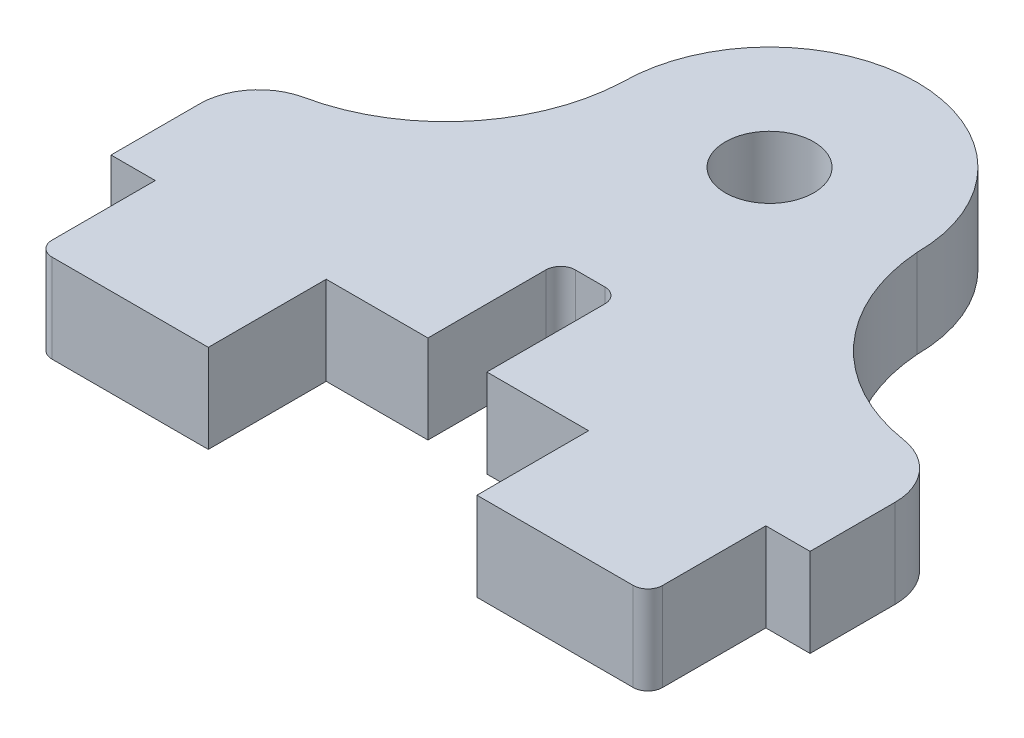
ISO-10303-21;
HEADER;
FILE_DESCRIPTION(('STEP AP214'),'2;1');
FILE_NAME('part.step','',(''),(''),'','','');
FILE_SCHEMA(('AUTOMOTIVE_DESIGN { 1 0 10303 214 1 1 1 1 }'));
ENDSEC;
DATA;
#1=APPLICATION_CONTEXT('core data for automotive mechanical design processes');
#2=APPLICATION_PROTOCOL_DEFINITION('international standard','automotive_design',2000,#1);
#3=PRODUCT_CONTEXT('',#1,'mechanical');
#4=PRODUCT('Part','Part','',(#3));
#5=PRODUCT_RELATED_PRODUCT_CATEGORY('part','',(#4));
#6=PRODUCT_DEFINITION_FORMATION('','',#4);
#7=PRODUCT_DEFINITION_CONTEXT('part definition',#1,'design');
#8=PRODUCT_DEFINITION('design','',#6,#7);
#9=PRODUCT_DEFINITION_SHAPE('','',#8);
#10=(LENGTH_UNIT() NAMED_UNIT(*) SI_UNIT(.MILLI.,.METRE.));
#11=(NAMED_UNIT(*) PLANE_ANGLE_UNIT() SI_UNIT($,.RADIAN.));
#12=(NAMED_UNIT(*) SI_UNIT($,.STERADIAN.) SOLID_ANGLE_UNIT());
#13=UNCERTAINTY_MEASURE_WITH_UNIT(LENGTH_MEASURE(1.E-05),#10,'distance_accuracy_value','');
#14=(GEOMETRIC_REPRESENTATION_CONTEXT(3) GLOBAL_UNCERTAINTY_ASSIGNED_CONTEXT((#13)) GLOBAL_UNIT_ASSIGNED_CONTEXT((#10,
#11,#12)) REPRESENTATION_CONTEXT('',''));
#15=CARTESIAN_POINT('',(0.,0.,0.));
#16=DIRECTION('',(0.,0.,1.));
#17=DIRECTION('',(1.,0.,0.));
#18=AXIS2_PLACEMENT_3D('',#15,#16,#17);
#19=CARTESIAN_POINT('',(11.2433699404445,3.,-0.455995380189233));
#20=DIRECTION('',(0.,-1.,0.));
#21=DIRECTION('',(0.,0.,-1.));
#22=AXIS2_PLACEMENT_3D('',#19,#20,#21);
#23=CYLINDRICAL_SURFACE('',#22,6.26);
#24=CARTESIAN_POINT('',(11.2433699404445,3.,-0.455995380189233));
#25=DIRECTION('',(0.,-1.,0.));
#26=DIRECTION('',(0.,0.,1.));
#27=AXIS2_PLACEMENT_3D('',#24,#25,#26);
#28=CIRCLE('',#27,6.26);
#29=CARTESIAN_POINT('',(10.2772699273665,3.,5.72900670265041));
#30=VERTEX_POINT('',#29);
#31=CARTESIAN_POINT('',(5.,3.,0.));
#32=VERTEX_POINT('',#31);
#33=EDGE_CURVE('E204',#30,#32,#28,.T.);
#34=ORIENTED_EDGE('',*,*,#33,.F.);
#35=DIRECTION('',(0.,-1.,0.));
#36=VECTOR('',#35,1.);
#37=CARTESIAN_POINT('',(10.2772699273665,3.,5.72900670265041));
#38=LINE('',#37,#36);
#39=CARTESIAN_POINT('',(10.2772699273665,0.,5.72900670265041));
#40=VERTEX_POINT('',#39);
#41=EDGE_CURVE('E259',#30,#40,#38,.T.);
#42=ORIENTED_EDGE('',*,*,#41,.T.);
#43=CARTESIAN_POINT('',(11.2433699404445,0.,-0.455995380189233));
#44=DIRECTION('',(0.,-1.,0.));
#45=DIRECTION('',(0.,0.,1.));
#46=AXIS2_PLACEMENT_3D('',#43,#44,#45);
#47=CIRCLE('',#46,6.26);
#48=CARTESIAN_POINT('',(5.,0.,0.));
#49=VERTEX_POINT('',#48);
#50=EDGE_CURVE('E232',#40,#49,#47,.T.);
#51=ORIENTED_EDGE('',*,*,#50,.T.);
#52=DIRECTION('',(0.,-1.,0.));
#53=VECTOR('',#52,1.);
#54=CARTESIAN_POINT('',(5.,3.,0.));
#55=LINE('',#54,#53);
#56=EDGE_CURVE('E224',#32,#49,#55,.T.);
#57=ORIENTED_EDGE('',*,*,#56,.F.);
#58=EDGE_LOOP('',(#34,#42,#51,#57));
#59=FACE_BOUND('',#58,.T.);
#60=ADVANCED_FACE('F43',(#59),#23,.F.);
#61=CARTESIAN_POINT('',(0.,3.,0.));
#62=DIRECTION('',(0.,-1.,0.));
#63=DIRECTION('',(0.,0.,-1.));
#64=AXIS2_PLACEMENT_3D('',#61,#62,#63);
#65=CYLINDRICAL_SURFACE('',#64,5.);
#66=CARTESIAN_POINT('',(0.,0.,0.));
#67=DIRECTION('',(0.,1.,0.));
#68=DIRECTION('',(0.,0.,1.));
#69=AXIS2_PLACEMENT_3D('',#66,#67,#68);
#70=CIRCLE('',#69,5.);
#71=CARTESIAN_POINT('',(-5.,0.,0.));
#72=VERTEX_POINT('',#71);
#73=EDGE_CURVE('E367',#49,#72,#70,.T.);
#74=ORIENTED_EDGE('',*,*,#73,.T.);
#75=DIRECTION('',(0.,-1.,0.));
#76=VECTOR('',#75,1.);
#77=CARTESIAN_POINT('',(-5.,3.,0.));
#78=LINE('',#77,#76);
#79=CARTESIAN_POINT('',(-5.,3.,0.));
#80=VERTEX_POINT('',#79);
#81=EDGE_CURVE('E226',#80,#72,#78,.T.);
#82=ORIENTED_EDGE('',*,*,#81,.F.);
#83=CARTESIAN_POINT('',(0.,3.,0.));
#84=DIRECTION('',(0.,1.,0.));
#85=DIRECTION('',(0.,0.,1.));
#86=AXIS2_PLACEMENT_3D('',#83,#84,#85);
#87=CIRCLE('',#86,5.);
#88=EDGE_CURVE('E209',#32,#80,#87,.T.);
#89=ORIENTED_EDGE('',*,*,#88,.F.);
#90=ORIENTED_EDGE('',*,*,#56,.T.);
#91=EDGE_LOOP('',(#74,#82,#89,#90));
#92=FACE_BOUND('',#91,.T.);
#93=ADVANCED_FACE('F223',(#92),#65,.T.);
#94=CARTESIAN_POINT('',(-11.2526114962713,3.,-0.278776727505315));
#95=DIRECTION('',(0.,-1.,0.));
#96=DIRECTION('',(0.,0.,-1.));
#97=AXIS2_PLACEMENT_3D('',#94,#95,#96);
#98=CYLINDRICAL_SURFACE('',#97,6.25882313115674);
#99=CARTESIAN_POINT('',(-11.2526114962713,0.,-0.278776727505315));
#100=DIRECTION('',(0.,-1.,0.));
#101=DIRECTION('',(0.,0.,1.));
#102=AXIS2_PLACEMENT_3D('',#99,#100,#101);
#103=CIRCLE('',#102,6.25882313115674);
#104=CARTESIAN_POINT('',(-9.94820869448056,0.,5.84261202977707));
#105=VERTEX_POINT('',#104);
#106=EDGE_CURVE('E371',#72,#105,#103,.T.);
#107=ORIENTED_EDGE('',*,*,#106,.T.);
#108=DIRECTION('',(0.,-1.,0.));
#109=VECTOR('',#108,1.);
#110=CARTESIAN_POINT('',(-9.94820869448056,3.,5.84261202977707));
#111=LINE('',#110,#109);
#112=CARTESIAN_POINT('',(-9.94820869448056,3.,5.84261202977707));
#113=VERTEX_POINT('',#112);
#114=EDGE_CURVE('E251',#105,#113,#111,.F.);
#115=ORIENTED_EDGE('',*,*,#114,.T.);
#116=CARTESIAN_POINT('',(-11.2526114962713,3.,-0.278776727505315));
#117=DIRECTION('',(0.,-1.,0.));
#118=DIRECTION('',(0.,0.,1.));
#119=AXIS2_PLACEMENT_3D('',#116,#117,#118);
#120=CIRCLE('',#119,6.25882313115674);
#121=EDGE_CURVE('E229',#80,#113,#120,.T.);
#122=ORIENTED_EDGE('',*,*,#121,.F.);
#123=ORIENTED_EDGE('',*,*,#81,.T.);
#124=EDGE_LOOP('',(#107,#115,#122,#123));
#125=FACE_BOUND('',#124,.T.);
#126=ADVANCED_FACE('F507',(#125),#98,.F.);
#127=CARTESIAN_POINT('',(-11.5313882237766,3.,10.8064133508319));
#128=DIRECTION('',(1.,0.,0.));
#129=DIRECTION('',(0.,0.,-1.));
#130=AXIS2_PLACEMENT_3D('',#127,#128,#129);
#131=PLANE('',#130);
#132=DIRECTION('',(0.,0.,1.));
#133=VECTOR('',#132,1.);
#134=CARTESIAN_POINT('',(-11.5313882237766,3.,10.8064133508319));
#135=LINE('',#134,#133);
#136=CARTESIAN_POINT('',(-11.5313882237766,3.,7.79869502781221));
#137=VERTEX_POINT('',#136);
#138=CARTESIAN_POINT('',(-11.5313882237766,3.,10.8064133508319));
#139=VERTEX_POINT('',#138);
#140=EDGE_CURVE('E816',#137,#139,#135,.T.);
#141=ORIENTED_EDGE('',*,*,#140,.F.);
#142=DIRECTION('',(0.,-1.,0.));
#143=VECTOR('',#142,1.);
#144=CARTESIAN_POINT('',(-11.5313882237766,3.,7.79869502781221));
#145=LINE('',#144,#143);
#146=CARTESIAN_POINT('',(-11.5313882237766,0.,7.79869502781221));
#147=VERTEX_POINT('',#146);
#148=EDGE_CURVE('E235',#137,#147,#145,.T.);
#149=ORIENTED_EDGE('',*,*,#148,.T.);
#150=DIRECTION('',(0.,0.,1.));
#151=VECTOR('',#150,1.);
#152=CARTESIAN_POINT('',(-11.5313882237766,0.,10.8064133508319));
#153=LINE('',#152,#151);
#154=CARTESIAN_POINT('',(-11.5313882237766,0.,10.8064133508319));
#155=VERTEX_POINT('',#154);
#156=EDGE_CURVE('E375',#147,#155,#153,.T.);
#157=ORIENTED_EDGE('',*,*,#156,.T.);
#158=DIRECTION('',(0.,-1.,0.));
#159=VECTOR('',#158,1.);
#160=CARTESIAN_POINT('',(-11.5313882237766,3.,10.8064133508319));
#161=LINE('',#160,#159);
#162=EDGE_CURVE('E242',#139,#155,#161,.T.);
#163=ORIENTED_EDGE('',*,*,#162,.F.);
#164=EDGE_LOOP('',(#141,#149,#157,#163));
#165=FACE_BOUND('',#164,.T.);
#166=ADVANCED_FACE('F685',(#165),#131,.F.);
#167=CARTESIAN_POINT('',(-11.5313882237766,3.,10.8064133508319));
#168=DIRECTION('',(0.,0.,-1.));
#169=DIRECTION('',(-1.,0.,0.));
#170=AXIS2_PLACEMENT_3D('',#167,#168,#169);
#171=PLANE('',#170);
#172=DIRECTION('',(1.,0.,0.));
#173=VECTOR('',#172,1.);
#174=CARTESIAN_POINT('',(-11.5313882237766,0.,10.8064133508319));
#175=LINE('',#174,#173);
#176=CARTESIAN_POINT('',(-10.0313882237766,0.,10.8064133508319));
#177=VERTEX_POINT('',#176);
#178=EDGE_CURVE('E378',#155,#177,#175,.T.);
#179=ORIENTED_EDGE('',*,*,#178,.T.);
#180=DIRECTION('',(0.,-1.,0.));
#181=VECTOR('',#180,1.);
#182=CARTESIAN_POINT('',(-10.0313882237766,3.,10.8064133508319));
#183=LINE('',#182,#181);
#184=CARTESIAN_POINT('',(-10.0313882237766,3.,10.8064133508319));
#185=VERTEX_POINT('',#184);
#186=EDGE_CURVE('E446',#185,#177,#183,.T.);
#187=ORIENTED_EDGE('',*,*,#186,.F.);
#188=DIRECTION('',(1.,0.,0.));
#189=VECTOR('',#188,1.);
#190=CARTESIAN_POINT('',(-11.5313882237766,3.,10.8064133508319));
#191=LINE('',#190,#189);
#192=EDGE_CURVE('E457',#139,#185,#191,.T.);
#193=ORIENTED_EDGE('',*,*,#192,.F.);
#194=ORIENTED_EDGE('',*,*,#162,.T.);
#195=EDGE_LOOP('',(#179,#187,#193,#194));
#196=FACE_BOUND('',#195,.T.);
#197=ADVANCED_FACE('F455',(#196),#171,.F.);
#198=CARTESIAN_POINT('',(-10.0313882237766,3.,10.8064133508319));
#199=DIRECTION('',(1.,0.,0.));
#200=DIRECTION('',(0.,0.,-1.));
#201=AXIS2_PLACEMENT_3D('',#198,#199,#200);
#202=PLANE('',#201);
#203=DIRECTION('',(0.,0.,1.));
#204=VECTOR('',#203,1.);
#205=CARTESIAN_POINT('',(-10.0313882237766,0.,10.8064133508319));
#206=LINE('',#205,#204);
#207=CARTESIAN_POINT('',(-10.0313882237766,0.,14.3064133508319));
#208=VERTEX_POINT('',#207);
#209=EDGE_CURVE('E381',#177,#208,#206,.T.);
#210=ORIENTED_EDGE('',*,*,#209,.T.);
#211=DIRECTION('',(0.,-1.,0.));
#212=VECTOR('',#211,1.);
#213=CARTESIAN_POINT('',(-10.0313882237766,3.,14.3064133508319));
#214=LINE('',#213,#212);
#215=CARTESIAN_POINT('',(-10.0313882237766,3.,14.3064133508319));
#216=VERTEX_POINT('',#215);
#217=EDGE_CURVE('E301',#208,#216,#214,.F.);
#218=ORIENTED_EDGE('',*,*,#217,.T.);
#219=DIRECTION('',(0.,0.,1.));
#220=VECTOR('',#219,1.);
#221=CARTESIAN_POINT('',(-10.0313882237766,3.,10.8064133508319));
#222=LINE('',#221,#220);
#223=EDGE_CURVE('E474',#185,#216,#222,.T.);
#224=ORIENTED_EDGE('',*,*,#223,.F.);
#225=ORIENTED_EDGE('',*,*,#186,.T.);
#226=EDGE_LOOP('',(#210,#218,#224,#225));
#227=FACE_BOUND('',#226,.T.);
#228=ADVANCED_FACE('F465',(#227),#202,.F.);
#229=CARTESIAN_POINT('',(-10.0313882237766,3.,14.8064133508319));
#230=DIRECTION('',(0.,0.,-1.));
#231=DIRECTION('',(-1.,0.,0.));
#232=AXIS2_PLACEMENT_3D('',#229,#230,#231);
#233=PLANE('',#232);
#234=DIRECTION('',(1.,0.,0.));
#235=VECTOR('',#234,1.);
#236=CARTESIAN_POINT('',(-10.0313882237766,3.,14.8064133508319));
#237=LINE('',#236,#235);
#238=CARTESIAN_POINT('',(-9.53138822377661,3.,14.8064133508319));
#239=VERTEX_POINT('',#238);
#240=CARTESIAN_POINT('',(-4.23138822377662,3.,14.8064133508319));
#241=VERTEX_POINT('',#240);
#242=EDGE_CURVE('E472',#239,#241,#237,.T.);
#243=ORIENTED_EDGE('',*,*,#242,.F.);
#244=DIRECTION('',(0.,-1.,0.));
#245=VECTOR('',#244,1.);
#246=CARTESIAN_POINT('',(-9.53138822377661,3.,14.8064133508319));
#247=LINE('',#246,#245);
#248=CARTESIAN_POINT('',(-9.53138822377661,0.,14.8064133508319));
#249=VERTEX_POINT('',#248);
#250=EDGE_CURVE('E297',#239,#249,#247,.T.);
#251=ORIENTED_EDGE('',*,*,#250,.T.);
#252=DIRECTION('',(1.,0.,0.));
#253=VECTOR('',#252,1.);
#254=CARTESIAN_POINT('',(-10.0313882237766,0.,14.8064133508319));
#255=LINE('',#254,#253);
#256=CARTESIAN_POINT('',(-4.23138822377662,0.,14.8064133508319));
#257=VERTEX_POINT('',#256);
#258=EDGE_CURVE('E385',#249,#257,#255,.T.);
#259=ORIENTED_EDGE('',*,*,#258,.T.);
#260=DIRECTION('',(0.,-1.,0.));
#261=VECTOR('',#260,1.);
#262=CARTESIAN_POINT('',(-4.23138822377662,3.,14.8064133508319));
#263=LINE('',#262,#261);
#264=EDGE_CURVE('E442',#241,#257,#263,.T.);
#265=ORIENTED_EDGE('',*,*,#264,.F.);
#266=EDGE_LOOP('',(#243,#251,#259,#265));
#267=FACE_BOUND('',#266,.T.);
#268=ADVANCED_FACE('F476',(#267),#233,.F.);
#269=CARTESIAN_POINT('',(-4.23138822377662,3.,14.8064133508319));
#270=DIRECTION('',(-1.,0.,0.));
#271=DIRECTION('',(0.,0.,1.));
#272=AXIS2_PLACEMENT_3D('',#269,#270,#271);
#273=PLANE('',#272);
#274=DIRECTION('',(0.,0.,-1.));
#275=VECTOR('',#274,1.);
#276=CARTESIAN_POINT('',(-4.23138822377662,0.,14.8064133508319));
#277=LINE('',#276,#275);
#278=CARTESIAN_POINT('',(-4.23138822377662,0.,10.8064133508319));
#279=VERTEX_POINT('',#278);
#280=EDGE_CURVE('E388',#257,#279,#277,.T.);
#281=ORIENTED_EDGE('',*,*,#280,.T.);
#282=DIRECTION('',(0.,-1.,0.));
#283=VECTOR('',#282,1.);
#284=CARTESIAN_POINT('',(-4.23138822377662,3.,10.8064133508319));
#285=LINE('',#284,#283);
#286=CARTESIAN_POINT('',(-4.23138822377662,3.,10.8064133508319));
#287=VERTEX_POINT('',#286);
#288=EDGE_CURVE('E438',#287,#279,#285,.T.);
#289=ORIENTED_EDGE('',*,*,#288,.F.);
#290=DIRECTION('',(0.,0.,-1.));
#291=VECTOR('',#290,1.);
#292=CARTESIAN_POINT('',(-4.23138822377662,3.,14.8064133508319));
#293=LINE('',#292,#291);
#294=EDGE_CURVE('E479',#241,#287,#293,.T.);
#295=ORIENTED_EDGE('',*,*,#294,.F.);
#296=ORIENTED_EDGE('',*,*,#264,.T.);
#297=EDGE_LOOP('',(#281,#289,#295,#296));
#298=FACE_BOUND('',#297,.T.);
#299=ADVANCED_FACE('F493',(#298),#273,.F.);
#300=CARTESIAN_POINT('',(-4.23138822377662,3.,10.8064133508319));
#301=DIRECTION('',(0.,0.,-1.));
#302=DIRECTION('',(-1.,0.,0.));
#303=AXIS2_PLACEMENT_3D('',#300,#301,#302);
#304=PLANE('',#303);
#305=DIRECTION('',(1.,0.,0.));
#306=VECTOR('',#305,1.);
#307=CARTESIAN_POINT('',(-4.23138822377662,0.,10.8064133508319));
#308=LINE('',#307,#306);
#309=CARTESIAN_POINT('',(-0.781388223776621,0.,10.8064133508319));
#310=VERTEX_POINT('',#309);
#311=EDGE_CURVE('E329',#279,#310,#308,.T.);
#312=ORIENTED_EDGE('',*,*,#311,.T.);
#313=DIRECTION('',(0.,-1.,0.));
#314=VECTOR('',#313,1.);
#315=CARTESIAN_POINT('',(-0.781388223776621,3.,10.8064133508319));
#316=LINE('',#315,#314);
#317=CARTESIAN_POINT('',(-0.781388223776621,3.,10.8064133508319));
#318=VERTEX_POINT('',#317);
#319=EDGE_CURVE('E327',#318,#310,#316,.T.);
#320=ORIENTED_EDGE('',*,*,#319,.F.);
#321=DIRECTION('',(1.,0.,0.));
#322=VECTOR('',#321,1.);
#323=CARTESIAN_POINT('',(-4.23138822377662,3.,10.8064133508319));
#324=LINE('',#323,#322);
#325=EDGE_CURVE('E343',#287,#318,#324,.T.);
#326=ORIENTED_EDGE('',*,*,#325,.F.);
#327=ORIENTED_EDGE('',*,*,#288,.T.);
#328=EDGE_LOOP('',(#312,#320,#326,#327));
#329=FACE_BOUND('',#328,.T.);
#330=ADVANCED_FACE('F490',(#329),#304,.F.);
#331=CARTESIAN_POINT('',(-0.781388223776621,3.,10.8064133508319));
#332=DIRECTION('',(-1.,0.,0.));
#333=DIRECTION('',(0.,0.,1.));
#334=AXIS2_PLACEMENT_3D('',#331,#332,#333);
#335=PLANE('',#334);
#336=DIRECTION('',(0.,0.,-1.));
#337=VECTOR('',#336,1.);
#338=CARTESIAN_POINT('',(-0.781388223776621,0.,10.8064133508319));
#339=LINE('',#338,#337);
#340=CARTESIAN_POINT('',(-0.781388223776621,0.,6.80641335083188));
#341=VERTEX_POINT('',#340);
#342=EDGE_CURVE('E316',#310,#341,#339,.T.);
#343=ORIENTED_EDGE('',*,*,#342,.T.);
#344=DIRECTION('',(0.,-1.,0.));
#345=VECTOR('',#344,1.);
#346=CARTESIAN_POINT('',(-0.781388223776621,3.,6.80641335083188));
#347=LINE('',#346,#345);
#348=CARTESIAN_POINT('',(-0.781388223776621,3.,6.80641335083188));
#349=VERTEX_POINT('',#348);
#350=EDGE_CURVE('E294',#341,#349,#347,.F.);
#351=ORIENTED_EDGE('',*,*,#350,.T.);
#352=DIRECTION('',(0.,0.,-1.));
#353=VECTOR('',#352,1.);
#354=CARTESIAN_POINT('',(-0.781388223776621,3.,10.8064133508319));
#355=LINE('',#354,#353);
#356=EDGE_CURVE('E334',#318,#349,#355,.T.);
#357=ORIENTED_EDGE('',*,*,#356,.F.);
#358=ORIENTED_EDGE('',*,*,#319,.T.);
#359=EDGE_LOOP('',(#343,#351,#357,#358));
#360=FACE_BOUND('',#359,.T.);
#361=ADVANCED_FACE('F323',(#360),#335,.F.);
#362=CARTESIAN_POINT('',(-0.781388223776621,3.,6.30641335083188));
#363=DIRECTION('',(0.,0.,-1.));
#364=DIRECTION('',(-1.,0.,0.));
#365=AXIS2_PLACEMENT_3D('',#362,#363,#364);
#366=PLANE('',#365);
#367=DIRECTION('',(1.,0.,0.));
#368=VECTOR('',#367,1.);
#369=CARTESIAN_POINT('',(-0.781388223776621,0.,6.30641335083188));
#370=LINE('',#369,#368);
#371=CARTESIAN_POINT('',(-0.281388223776621,0.,6.30641335083188));
#372=VERTEX_POINT('',#371);
#373=CARTESIAN_POINT('',(0.718611776223377,0.,6.30641335083188));
#374=VERTEX_POINT('',#373);
#375=EDGE_CURVE('E317',#372,#374,#370,.T.);
#376=ORIENTED_EDGE('',*,*,#375,.T.);
#377=DIRECTION('',(0.,-1.,0.));
#378=VECTOR('',#377,1.);
#379=CARTESIAN_POINT('',(0.718611776223377,3.,6.30641335083188));
#380=LINE('',#379,#378);
#381=CARTESIAN_POINT('',(0.718611776223377,3.,6.30641335083188));
#382=VERTEX_POINT('',#381);
#383=EDGE_CURVE('E67',#374,#382,#380,.F.);
#384=ORIENTED_EDGE('',*,*,#383,.T.);
#385=DIRECTION('',(1.,0.,0.));
#386=VECTOR('',#385,1.);
#387=CARTESIAN_POINT('',(-0.781388223776621,3.,6.30641335083188));
#388=LINE('',#387,#386);
#389=CARTESIAN_POINT('',(-0.281388223776621,3.,6.30641335083188));
#390=VERTEX_POINT('',#389);
#391=EDGE_CURVE('E333',#390,#382,#388,.T.);
#392=ORIENTED_EDGE('',*,*,#391,.F.);
#393=DIRECTION('',(0.,-1.,0.));
#394=VECTOR('',#393,1.);
#395=CARTESIAN_POINT('',(-0.281388223776621,0.,6.30641335083188));
#396=LINE('',#395,#394);
#397=EDGE_CURVE('E288',#390,#372,#396,.T.);
#398=ORIENTED_EDGE('',*,*,#397,.T.);
#399=EDGE_LOOP('',(#376,#384,#392,#398));
#400=FACE_BOUND('',#399,.T.);
#401=ADVANCED_FACE('F335',(#400),#366,.F.);
#402=CARTESIAN_POINT('',(1.21861177622338,3.,6.30641335083188));
#403=DIRECTION('',(1.,0.,0.));
#404=DIRECTION('',(0.,0.,-1.));
#405=AXIS2_PLACEMENT_3D('',#402,#403,#404);
#406=PLANE('',#405);
#407=DIRECTION('',(0.,0.,1.));
#408=VECTOR('',#407,1.);
#409=CARTESIAN_POINT('',(1.21861177622338,3.,6.30641335083188));
#410=LINE('',#409,#408);
#411=CARTESIAN_POINT('',(1.21861177622338,3.,6.80641335083188));
#412=VERTEX_POINT('',#411);
#413=CARTESIAN_POINT('',(1.21861177622338,3.,10.8064133508319));
#414=VERTEX_POINT('',#413);
#415=EDGE_CURVE('E337',#412,#414,#410,.T.);
#416=ORIENTED_EDGE('',*,*,#415,.F.);
#417=DIRECTION('',(0.,-1.,0.));
#418=VECTOR('',#417,1.);
#419=CARTESIAN_POINT('',(1.21861177622338,0.,6.80641335083188));
#420=LINE('',#419,#418);
#421=CARTESIAN_POINT('',(1.21861177622338,0.,6.80641335083188));
#422=VERTEX_POINT('',#421);
#423=EDGE_CURVE('E284',#412,#422,#420,.T.);
#424=ORIENTED_EDGE('',*,*,#423,.T.);
#425=DIRECTION('',(0.,0.,1.));
#426=VECTOR('',#425,1.);
#427=CARTESIAN_POINT('',(1.21861177622338,0.,6.30641335083188));
#428=LINE('',#427,#426);
#429=CARTESIAN_POINT('',(1.21861177622338,0.,10.8064133508319));
#430=VERTEX_POINT('',#429);
#431=EDGE_CURVE('E395',#422,#430,#428,.T.);
#432=ORIENTED_EDGE('',*,*,#431,.T.);
#433=DIRECTION('',(0.,-1.,0.));
#434=VECTOR('',#433,1.);
#435=CARTESIAN_POINT('',(1.21861177622338,3.,10.8064133508319));
#436=LINE('',#435,#434);
#437=EDGE_CURVE('E432',#414,#430,#436,.T.);
#438=ORIENTED_EDGE('',*,*,#437,.F.);
#439=EDGE_LOOP('',(#416,#424,#432,#438));
#440=FACE_BOUND('',#439,.T.);
#441=ADVANCED_FACE('F612',(#440),#406,.F.);
#442=CARTESIAN_POINT('',(1.21861177622338,3.,10.8064133508319));
#443=DIRECTION('',(0.,0.,-1.));
#444=DIRECTION('',(-1.,0.,0.));
#445=AXIS2_PLACEMENT_3D('',#442,#443,#444);
#446=PLANE('',#445);
#447=DIRECTION('',(1.,0.,0.));
#448=VECTOR('',#447,1.);
#449=CARTESIAN_POINT('',(1.21861177622338,0.,10.8064133508319));
#450=LINE('',#449,#448);
#451=CARTESIAN_POINT('',(4.66861177622338,0.,10.8064133508319));
#452=VERTEX_POINT('',#451);
#453=EDGE_CURVE('E398',#430,#452,#450,.T.);
#454=ORIENTED_EDGE('',*,*,#453,.T.);
#455=DIRECTION('',(0.,-1.,0.));
#456=VECTOR('',#455,1.);
#457=CARTESIAN_POINT('',(4.66861177622338,3.,10.8064133508319));
#458=LINE('',#457,#456);
#459=CARTESIAN_POINT('',(4.66861177622338,3.,10.8064133508319));
#460=VERTEX_POINT('',#459);
#461=EDGE_CURVE('E428',#460,#452,#458,.T.);
#462=ORIENTED_EDGE('',*,*,#461,.F.);
#463=DIRECTION('',(1.,0.,0.));
#464=VECTOR('',#463,1.);
#465=CARTESIAN_POINT('',(1.21861177622338,3.,10.8064133508319));
#466=LINE('',#465,#464);
#467=EDGE_CURVE('E341',#414,#460,#466,.T.);
#468=ORIENTED_EDGE('',*,*,#467,.F.);
#469=ORIENTED_EDGE('',*,*,#437,.T.);
#470=EDGE_LOOP('',(#454,#462,#468,#469));
#471=FACE_BOUND('',#470,.T.);
#472=ADVANCED_FACE('F617',(#471),#446,.F.);
#473=CARTESIAN_POINT('',(4.66861177622338,3.,14.5944304402411));
#474=DIRECTION('',(1.,0.,0.));
#475=DIRECTION('',(0.,0.,-1.));
#476=AXIS2_PLACEMENT_3D('',#473,#474,#475);
#477=PLANE('',#476);
#478=DIRECTION('',(0.,0.,1.));
#479=VECTOR('',#478,1.);
#480=CARTESIAN_POINT('',(4.66861177622338,0.,14.5944304402411));
#481=LINE('',#480,#479);
#482=CARTESIAN_POINT('',(4.66861177622338,0.,14.5944304402411));
#483=VERTEX_POINT('',#482);
#484=EDGE_CURVE('E401',#452,#483,#481,.T.);
#485=ORIENTED_EDGE('',*,*,#484,.T.);
#486=DIRECTION('',(0.,-1.,0.));
#487=VECTOR('',#486,1.);
#488=CARTESIAN_POINT('',(4.66861177622338,3.,14.5944304402411));
#489=LINE('',#488,#487);
#490=CARTESIAN_POINT('',(4.66861177622338,3.,14.5944304402411));
#491=VERTEX_POINT('',#490);
#492=EDGE_CURVE('E424',#491,#483,#489,.T.);
#493=ORIENTED_EDGE('',*,*,#492,.F.);
#494=DIRECTION('',(0.,0.,1.));
#495=VECTOR('',#494,1.);
#496=CARTESIAN_POINT('',(4.66861177622338,3.,14.5944304402411));
#497=LINE('',#496,#495);
#498=EDGE_CURVE('E349',#460,#491,#497,.T.);
#499=ORIENTED_EDGE('',*,*,#498,.F.);
#500=ORIENTED_EDGE('',*,*,#461,.T.);
#501=EDGE_LOOP('',(#485,#493,#499,#500));
#502=FACE_BOUND('',#501,.T.);
#503=ADVANCED_FACE('F603',(#502),#477,.F.);
#504=CARTESIAN_POINT('',(10.4686117762234,3.,14.5944304402411));
#505=DIRECTION('',(0.,0.,-1.));
#506=DIRECTION('',(-1.,0.,0.));
#507=AXIS2_PLACEMENT_3D('',#504,#505,#506);
#508=PLANE('',#507);
#509=DIRECTION('',(1.,0.,0.));
#510=VECTOR('',#509,1.);
#511=CARTESIAN_POINT('',(10.4686117762234,0.,14.5944304402411));
#512=LINE('',#511,#510);
#513=CARTESIAN_POINT('',(9.96861177622338,0.,14.5944304402411));
#514=VERTEX_POINT('',#513);
#515=EDGE_CURVE('E404',#483,#514,#512,.T.);
#516=ORIENTED_EDGE('',*,*,#515,.T.);
#517=DIRECTION('',(0.,-1.,0.));
#518=VECTOR('',#517,1.);
#519=CARTESIAN_POINT('',(9.96861177622338,3.,14.5944304402411));
#520=LINE('',#519,#518);
#521=CARTESIAN_POINT('',(9.96861177622338,3.,14.5944304402411));
#522=VERTEX_POINT('',#521);
#523=EDGE_CURVE('E275',#514,#522,#520,.F.);
#524=ORIENTED_EDGE('',*,*,#523,.T.);
#525=DIRECTION('',(1.,0.,0.));
#526=VECTOR('',#525,1.);
#527=CARTESIAN_POINT('',(10.4686117762234,3.,14.5944304402411));
#528=LINE('',#527,#526);
#529=EDGE_CURVE('E352',#491,#522,#528,.T.);
#530=ORIENTED_EDGE('',*,*,#529,.F.);
#531=ORIENTED_EDGE('',*,*,#492,.T.);
#532=EDGE_LOOP('',(#516,#524,#530,#531));
#533=FACE_BOUND('',#532,.T.);
#534=ADVANCED_FACE('F590',(#533),#508,.F.);
#535=CARTESIAN_POINT('',(10.4686117762234,3.,10.5944304402411));
#536=DIRECTION('',(-1.,0.,0.));
#537=DIRECTION('',(0.,0.,1.));
#538=AXIS2_PLACEMENT_3D('',#535,#536,#537);
#539=PLANE('',#538);
#540=DIRECTION('',(0.,0.,-1.));
#541=VECTOR('',#540,1.);
#542=CARTESIAN_POINT('',(10.4686117762234,3.,10.5944304402411));
#543=LINE('',#542,#541);
#544=CARTESIAN_POINT('',(10.4686117762234,3.,14.0944304402411));
#545=VERTEX_POINT('',#544);
#546=CARTESIAN_POINT('',(10.4686117762234,3.,10.5944304402411));
#547=VERTEX_POINT('',#546);
#548=EDGE_CURVE('E355',#545,#547,#543,.T.);
#549=ORIENTED_EDGE('',*,*,#548,.F.);
#550=DIRECTION('',(0.,-1.,0.));
#551=VECTOR('',#550,1.);
#552=CARTESIAN_POINT('',(10.4686117762234,3.,14.0944304402411));
#553=LINE('',#552,#551);
#554=CARTESIAN_POINT('',(10.4686117762234,0.,14.0944304402411));
#555=VERTEX_POINT('',#554);
#556=EDGE_CURVE('E265',#545,#555,#553,.T.);
#557=ORIENTED_EDGE('',*,*,#556,.T.);
#558=DIRECTION('',(0.,0.,-1.));
#559=VECTOR('',#558,1.);
#560=CARTESIAN_POINT('',(10.4686117762234,0.,10.5944304402411));
#561=LINE('',#560,#559);
#562=CARTESIAN_POINT('',(10.4686117762234,0.,10.5944304402411));
#563=VERTEX_POINT('',#562);
#564=EDGE_CURVE('E408',#555,#563,#561,.T.);
#565=ORIENTED_EDGE('',*,*,#564,.T.);
#566=DIRECTION('',(0.,-1.,0.));
#567=VECTOR('',#566,1.);
#568=CARTESIAN_POINT('',(10.4686117762234,3.,10.5944304402411));
#569=LINE('',#568,#567);
#570=EDGE_CURVE('E420',#547,#563,#569,.T.);
#571=ORIENTED_EDGE('',*,*,#570,.F.);
#572=EDGE_LOOP('',(#549,#557,#565,#571));
#573=FACE_BOUND('',#572,.T.);
#574=ADVANCED_FACE('F584',(#573),#539,.F.);
#575=CARTESIAN_POINT('',(11.9686117762234,3.,10.5944304402411));
#576=DIRECTION('',(0.,0.,-1.));
#577=DIRECTION('',(-1.,0.,0.));
#578=AXIS2_PLACEMENT_3D('',#575,#576,#577);
#579=PLANE('',#578);
#580=DIRECTION('',(1.,0.,0.));
#581=VECTOR('',#580,1.);
#582=CARTESIAN_POINT('',(11.9686117762234,0.,10.5944304402411));
#583=LINE('',#582,#581);
#584=CARTESIAN_POINT('',(11.9686117762234,0.,10.5944304402411));
#585=VERTEX_POINT('',#584);
#586=EDGE_CURVE('E411',#563,#585,#583,.T.);
#587=ORIENTED_EDGE('',*,*,#586,.T.);
#588=DIRECTION('',(0.,-1.,0.));
#589=VECTOR('',#588,1.);
#590=CARTESIAN_POINT('',(11.9686117762234,3.,10.5944304402411));
#591=LINE('',#590,#589);
#592=CARTESIAN_POINT('',(11.9686117762234,3.,10.5944304402411));
#593=VERTEX_POINT('',#592);
#594=EDGE_CURVE('E364',#593,#585,#591,.T.);
#595=ORIENTED_EDGE('',*,*,#594,.F.);
#596=DIRECTION('',(1.,0.,0.));
#597=VECTOR('',#596,1.);
#598=CARTESIAN_POINT('',(11.9686117762234,3.,10.5944304402411));
#599=LINE('',#598,#597);
#600=EDGE_CURVE('E358',#547,#593,#599,.T.);
#601=ORIENTED_EDGE('',*,*,#600,.F.);
#602=ORIENTED_EDGE('',*,*,#570,.T.);
#603=EDGE_LOOP('',(#587,#595,#601,#602));
#604=FACE_BOUND('',#603,.T.);
#605=ADVANCED_FACE('F589',(#604),#579,.F.);
#606=CARTESIAN_POINT('',(11.9686117762234,3.,5.76185185817519));
#607=DIRECTION('',(-1.,0.,0.));
#608=DIRECTION('',(0.,0.,1.));
#609=AXIS2_PLACEMENT_3D('',#606,#607,#608);
#610=PLANE('',#609);
#611=DIRECTION('',(0.,0.,-1.));
#612=VECTOR('',#611,1.);
#613=CARTESIAN_POINT('',(11.9686117762234,0.,5.76185185817519));
#614=LINE('',#613,#612);
#615=CARTESIAN_POINT('',(11.9686117762234,0.,7.70504570675253));
#616=VERTEX_POINT('',#615);
#617=EDGE_CURVE('E219',#585,#616,#614,.T.);
#618=ORIENTED_EDGE('',*,*,#617,.T.);
#619=DIRECTION('',(0.,-1.,0.));
#620=VECTOR('',#619,1.);
#621=CARTESIAN_POINT('',(11.9686117762234,3.,7.70504570675253));
#622=LINE('',#621,#620);
#623=CARTESIAN_POINT('',(11.9686117762234,3.,7.70504570675253));
#624=VERTEX_POINT('',#623);
#625=EDGE_CURVE('E262',#616,#624,#622,.F.);
#626=ORIENTED_EDGE('',*,*,#625,.T.);
#627=DIRECTION('',(0.,0.,-1.));
#628=VECTOR('',#627,1.);
#629=CARTESIAN_POINT('',(11.9686117762234,3.,5.76185185817519));
#630=LINE('',#629,#628);
#631=EDGE_CURVE('E361',#593,#624,#630,.T.);
#632=ORIENTED_EDGE('',*,*,#631,.F.);
#633=ORIENTED_EDGE('',*,*,#594,.T.);
#634=EDGE_LOOP('',(#618,#626,#632,#633));
#635=FACE_BOUND('',#634,.T.);
#636=ADVANCED_FACE('F575',(#635),#610,.F.);
#637=CARTESIAN_POINT('',(11.2433699404445,3.,-0.455995380189233));
#638=DIRECTION('',(0.,1.,0.));
#639=DIRECTION('',(0.,0.,1.));
#640=AXIS2_PLACEMENT_3D('',#637,#638,#639);
#641=PLANE('',#640);
#642=CARTESIAN_POINT('',(0.,3.,0.));
#643=DIRECTION('',(0.,1.,0.));
#644=DIRECTION('',(0.,0.,1.));
#645=AXIS2_PLACEMENT_3D('',#642,#643,#644);
#646=CIRCLE('',#645,1.5);
#647=CARTESIAN_POINT('',(0.,3.,1.5));
#648=VERTEX_POINT('',#647);
#649=EDGE_CURVE('E823',#648,#648,#646,.T.);
#650=ORIENTED_EDGE('',*,*,#649,.F.);
#651=EDGE_LOOP('',(#650));
#652=FACE_BOUND('',#651,.T.);
#653=ORIENTED_EDGE('',*,*,#529,.T.);
#654=CARTESIAN_POINT('',(9.96861177622338,3.,14.0944304402411));
#655=DIRECTION('',(0.,1.,0.));
#656=DIRECTION('',(0.,0.,1.));
#657=AXIS2_PLACEMENT_3D('',#654,#655,#656);
#658=CIRCLE('',#657,0.5);
#659=EDGE_CURVE('E281',#522,#545,#658,.T.);
#660=ORIENTED_EDGE('',*,*,#659,.T.);
#661=ORIENTED_EDGE('',*,*,#548,.T.);
#662=ORIENTED_EDGE('',*,*,#600,.T.);
#663=ORIENTED_EDGE('',*,*,#631,.T.);
#664=CARTESIAN_POINT('',(9.96861177622339,3.,7.70504570675253));
#665=DIRECTION('',(0.,1.,0.));
#666=DIRECTION('',(0.,0.,1.));
#667=AXIS2_PLACEMENT_3D('',#664,#665,#666);
#668=CIRCLE('',#667,2.);
#669=EDGE_CURVE('E213',#624,#30,#668,.T.);
#670=ORIENTED_EDGE('',*,*,#669,.T.);
#671=ORIENTED_EDGE('',*,*,#33,.T.);
#672=ORIENTED_EDGE('',*,*,#88,.T.);
#673=ORIENTED_EDGE('',*,*,#121,.T.);
#674=CARTESIAN_POINT('',(-9.53138822377661,3.,7.79869502781221));
#675=DIRECTION('',(0.,1.,0.));
#676=DIRECTION('',(0.,0.,1.));
#677=AXIS2_PLACEMENT_3D('',#674,#675,#676);
#678=CIRCLE('',#677,2.);
#679=EDGE_CURVE('E256',#113,#137,#678,.T.);
#680=ORIENTED_EDGE('',*,*,#679,.T.);
#681=ORIENTED_EDGE('',*,*,#140,.T.);
#682=ORIENTED_EDGE('',*,*,#192,.T.);
#683=ORIENTED_EDGE('',*,*,#223,.T.);
#684=CARTESIAN_POINT('',(-9.53138822377661,3.,14.3064133508319));
#685=DIRECTION('',(0.,1.,0.));
#686=DIRECTION('',(0.,0.,1.));
#687=AXIS2_PLACEMENT_3D('',#684,#685,#686);
#688=CIRCLE('',#687,0.5);
#689=EDGE_CURVE('E278',#216,#239,#688,.T.);
#690=ORIENTED_EDGE('',*,*,#689,.T.);
#691=ORIENTED_EDGE('',*,*,#242,.T.);
#692=ORIENTED_EDGE('',*,*,#294,.T.);
#693=ORIENTED_EDGE('',*,*,#325,.T.);
#694=ORIENTED_EDGE('',*,*,#356,.T.);
#695=CARTESIAN_POINT('',(-0.281388223776621,3.,6.80641335083188));
#696=DIRECTION('',(0.,1.,0.));
#697=DIRECTION('',(0.,0.,1.));
#698=AXIS2_PLACEMENT_3D('',#695,#696,#697);
#699=CIRCLE('',#698,0.5);
#700=EDGE_CURVE('E11',#349,#390,#699,.F.);
#701=ORIENTED_EDGE('',*,*,#700,.T.);
#702=ORIENTED_EDGE('',*,*,#391,.T.);
#703=CARTESIAN_POINT('',(0.718611776223377,3.,6.80641335083188));
#704=DIRECTION('',(0.,1.,0.));
#705=DIRECTION('',(0.,0.,1.));
#706=AXIS2_PLACEMENT_3D('',#703,#704,#705);
#707=CIRCLE('',#706,0.5);
#708=EDGE_CURVE('E59',#382,#412,#707,.F.);
#709=ORIENTED_EDGE('',*,*,#708,.T.);
#710=ORIENTED_EDGE('',*,*,#415,.T.);
#711=ORIENTED_EDGE('',*,*,#467,.T.);
#712=ORIENTED_EDGE('',*,*,#498,.T.);
#713=EDGE_LOOP('',(#653,#660,#661,#662,#663,#670,#671,#672,#673,#680,#681,#682,#683,#690,#691,
#692,#693,#694,#701,#702,#709,#710,#711,#712));
#714=FACE_BOUND('',#713,.T.);
#715=ADVANCED_FACE('F207',(#652,#714),#641,.T.);
#716=CARTESIAN_POINT('',(11.2433699404445,0.,-0.455995380189233));
#717=DIRECTION('',(0.,1.,0.));
#718=DIRECTION('',(0.,0.,1.));
#719=AXIS2_PLACEMENT_3D('',#716,#717,#718);
#720=PLANE('',#719);
#721=CARTESIAN_POINT('',(0.,0.,0.));
#722=DIRECTION('',(0.,1.,0.));
#723=DIRECTION('',(0.,0.,1.));
#724=AXIS2_PLACEMENT_3D('',#721,#722,#723);
#725=CIRCLE('',#724,1.5);
#726=CARTESIAN_POINT('',(0.,0.,1.5));
#727=VERTEX_POINT('',#726);
#728=EDGE_CURVE('E368',#727,#727,#725,.T.);
#729=ORIENTED_EDGE('',*,*,#728,.T.);
#730=EDGE_LOOP('',(#729));
#731=FACE_BOUND('',#730,.T.);
#732=ORIENTED_EDGE('',*,*,#564,.F.);
#733=CARTESIAN_POINT('',(9.96861177622338,0.,14.0944304402411));
#734=DIRECTION('',(0.,1.,0.));
#735=DIRECTION('',(0.,0.,1.));
#736=AXIS2_PLACEMENT_3D('',#733,#734,#735);
#737=CIRCLE('',#736,0.5);
#738=EDGE_CURVE('E272',#555,#514,#737,.F.);
#739=ORIENTED_EDGE('',*,*,#738,.T.);
#740=ORIENTED_EDGE('',*,*,#515,.F.);
#741=ORIENTED_EDGE('',*,*,#484,.F.);
#742=ORIENTED_EDGE('',*,*,#453,.F.);
#743=ORIENTED_EDGE('',*,*,#431,.F.);
#744=CARTESIAN_POINT('',(0.718611776223377,0.,6.80641335083188));
#745=DIRECTION('',(0.,1.,0.));
#746=DIRECTION('',(0.,0.,1.));
#747=AXIS2_PLACEMENT_3D('',#744,#745,#746);
#748=CIRCLE('',#747,0.5);
#749=EDGE_CURVE('E304',#422,#374,#748,.T.);
#750=ORIENTED_EDGE('',*,*,#749,.T.);
#751=ORIENTED_EDGE('',*,*,#375,.F.);
#752=CARTESIAN_POINT('',(-0.281388223776621,0.,6.80641335083188));
#753=DIRECTION('',(0.,1.,0.));
#754=DIRECTION('',(0.,0.,1.));
#755=AXIS2_PLACEMENT_3D('',#752,#753,#754);
#756=CIRCLE('',#755,0.5);
#757=EDGE_CURVE('E52',#372,#341,#756,.T.);
#758=ORIENTED_EDGE('',*,*,#757,.T.);
#759=ORIENTED_EDGE('',*,*,#342,.F.);
#760=ORIENTED_EDGE('',*,*,#311,.F.);
#761=ORIENTED_EDGE('',*,*,#280,.F.);
#762=ORIENTED_EDGE('',*,*,#258,.F.);
#763=CARTESIAN_POINT('',(-9.53138822377661,0.,14.3064133508319));
#764=DIRECTION('',(0.,1.,0.));
#765=DIRECTION('',(0.,0.,1.));
#766=AXIS2_PLACEMENT_3D('',#763,#764,#765);
#767=CIRCLE('',#766,0.5);
#768=EDGE_CURVE('E269',#249,#208,#767,.F.);
#769=ORIENTED_EDGE('',*,*,#768,.T.);
#770=ORIENTED_EDGE('',*,*,#209,.F.);
#771=ORIENTED_EDGE('',*,*,#178,.F.);
#772=ORIENTED_EDGE('',*,*,#156,.F.);
#773=CARTESIAN_POINT('',(-9.53138822377661,0.,7.79869502781221));
#774=DIRECTION('',(0.,1.,0.));
#775=DIRECTION('',(0.,0.,1.));
#776=AXIS2_PLACEMENT_3D('',#773,#774,#775);
#777=CIRCLE('',#776,2.);
#778=EDGE_CURVE('E248',#147,#105,#777,.F.);
#779=ORIENTED_EDGE('',*,*,#778,.T.);
#780=ORIENTED_EDGE('',*,*,#106,.F.);
#781=ORIENTED_EDGE('',*,*,#73,.F.);
#782=ORIENTED_EDGE('',*,*,#50,.F.);
#783=CARTESIAN_POINT('',(9.96861177622339,0.,7.70504570675253));
#784=DIRECTION('',(0.,1.,0.));
#785=DIRECTION('',(0.,0.,1.));
#786=AXIS2_PLACEMENT_3D('',#783,#784,#785);
#787=CIRCLE('',#786,2.);
#788=EDGE_CURVE('E240',#40,#616,#787,.F.);
#789=ORIENTED_EDGE('',*,*,#788,.T.);
#790=ORIENTED_EDGE('',*,*,#617,.F.);
#791=ORIENTED_EDGE('',*,*,#586,.F.);
#792=EDGE_LOOP('',(#732,#739,#740,#741,#742,#743,#750,#751,#758,#759,#760,#761,#762,#769,#770,
#771,#772,#779,#780,#781,#782,#789,#790,#791));
#793=FACE_BOUND('',#792,.T.);
#794=ADVANCED_FACE('F314',(#731,#793),#720,.F.);
#795=CARTESIAN_POINT('',(0.,0.,0.));
#796=DIRECTION('',(0.,1.,0.));
#797=DIRECTION('',(0.,0.,1.));
#798=AXIS2_PLACEMENT_3D('',#795,#796,#797);
#799=CYLINDRICAL_SURFACE('',#798,1.5);
#800=ORIENTED_EDGE('',*,*,#728,.F.);
#801=EDGE_LOOP('',(#800));
#802=FACE_BOUND('',#801,.T.);
#803=ORIENTED_EDGE('',*,*,#649,.T.);
#804=EDGE_LOOP('',(#803));
#805=FACE_BOUND('',#804,.T.);
#806=ADVANCED_FACE('F515',(#802,#805),#799,.F.);
#807=CARTESIAN_POINT('',(-9.53138822377661,3.,7.79869502781221));
#808=DIRECTION('',(0.,-1.,0.));
#809=DIRECTION('',(0.,0.,-1.));
#810=AXIS2_PLACEMENT_3D('',#807,#808,#809);
#811=CYLINDRICAL_SURFACE('',#810,2.);
#812=ORIENTED_EDGE('',*,*,#679,.F.);
#813=ORIENTED_EDGE('',*,*,#114,.F.);
#814=ORIENTED_EDGE('',*,*,#778,.F.);
#815=ORIENTED_EDGE('',*,*,#148,.F.);
#816=EDGE_LOOP('',(#812,#813,#814,#815));
#817=FACE_BOUND('',#816,.T.);
#818=ADVANCED_FACE('F511',(#817),#811,.T.);
#819=CARTESIAN_POINT('',(9.96861177622339,3.,7.70504570675253));
#820=DIRECTION('',(0.,-1.,0.));
#821=DIRECTION('',(0.,0.,-1.));
#822=AXIS2_PLACEMENT_3D('',#819,#820,#821);
#823=CYLINDRICAL_SURFACE('',#822,2.);
#824=ORIENTED_EDGE('',*,*,#669,.F.);
#825=ORIENTED_EDGE('',*,*,#625,.F.);
#826=ORIENTED_EDGE('',*,*,#788,.F.);
#827=ORIENTED_EDGE('',*,*,#41,.F.);
#828=EDGE_LOOP('',(#824,#825,#826,#827));
#829=FACE_BOUND('',#828,.T.);
#830=ADVANCED_FACE('F514',(#829),#823,.T.);
#831=CARTESIAN_POINT('',(9.96861177622338,3.,14.0944304402411));
#832=DIRECTION('',(0.,-1.,0.));
#833=DIRECTION('',(0.,0.,-1.));
#834=AXIS2_PLACEMENT_3D('',#831,#832,#833);
#835=CYLINDRICAL_SURFACE('',#834,0.5);
#836=ORIENTED_EDGE('',*,*,#659,.F.);
#837=ORIENTED_EDGE('',*,*,#523,.F.);
#838=ORIENTED_EDGE('',*,*,#738,.F.);
#839=ORIENTED_EDGE('',*,*,#556,.F.);
#840=EDGE_LOOP('',(#836,#837,#838,#839));
#841=FACE_BOUND('',#840,.T.);
#842=ADVANCED_FACE('F519',(#841),#835,.T.);
#843=CARTESIAN_POINT('',(0.718611776223377,3.,6.80641335083188));
#844=DIRECTION('',(0.,1.,0.));
#845=DIRECTION('',(0.,0.,1.));
#846=AXIS2_PLACEMENT_3D('',#843,#844,#845);
#847=CYLINDRICAL_SURFACE('',#846,0.5);
#848=ORIENTED_EDGE('',*,*,#708,.F.);
#849=ORIENTED_EDGE('',*,*,#383,.F.);
#850=ORIENTED_EDGE('',*,*,#749,.F.);
#851=ORIENTED_EDGE('',*,*,#423,.F.);
#852=EDGE_LOOP('',(#848,#849,#850,#851));
#853=FACE_BOUND('',#852,.T.);
#854=ADVANCED_FACE('F523',(#853),#847,.F.);
#855=CARTESIAN_POINT('',(-0.281388223776621,3.,6.80641335083188));
#856=DIRECTION('',(0.,1.,0.));
#857=DIRECTION('',(0.,0.,1.));
#858=AXIS2_PLACEMENT_3D('',#855,#856,#857);
#859=CYLINDRICAL_SURFACE('',#858,0.5);
#860=ORIENTED_EDGE('',*,*,#700,.F.);
#861=ORIENTED_EDGE('',*,*,#350,.F.);
#862=ORIENTED_EDGE('',*,*,#757,.F.);
#863=ORIENTED_EDGE('',*,*,#397,.F.);
#864=EDGE_LOOP('',(#860,#861,#862,#863));
#865=FACE_BOUND('',#864,.T.);
#866=ADVANCED_FACE('F332',(#865),#859,.F.);
#867=CARTESIAN_POINT('',(-9.53138822377661,3.,14.3064133508319));
#868=DIRECTION('',(0.,-1.,0.));
#869=DIRECTION('',(0.,0.,-1.));
#870=AXIS2_PLACEMENT_3D('',#867,#868,#869);
#871=CYLINDRICAL_SURFACE('',#870,0.5);
#872=ORIENTED_EDGE('',*,*,#689,.F.);
#873=ORIENTED_EDGE('',*,*,#217,.F.);
#874=ORIENTED_EDGE('',*,*,#768,.F.);
#875=ORIENTED_EDGE('',*,*,#250,.F.);
#876=EDGE_LOOP('',(#872,#873,#874,#875));
#877=FACE_BOUND('',#876,.T.);
#878=ADVANCED_FACE('F45',(#877),#871,.T.);
#879=CLOSED_SHELL('',(#60,#93,#126,#166,#197,#228,#268,#299,#330,#361,#401,#441,#472,#503,#534,
#574,#605,#636,#715,#794,#806,#818,#830,#842,#854,#866,#878));
#880=MANIFOLD_SOLID_BREP('B2',#879);
#881=ADVANCED_BREP_SHAPE_REPRESENTATION('',(#18,#880),#14);
#882=SHAPE_DEFINITION_REPRESENTATION(#9,#881);
ENDSEC;
END-ISO-10303-21;
